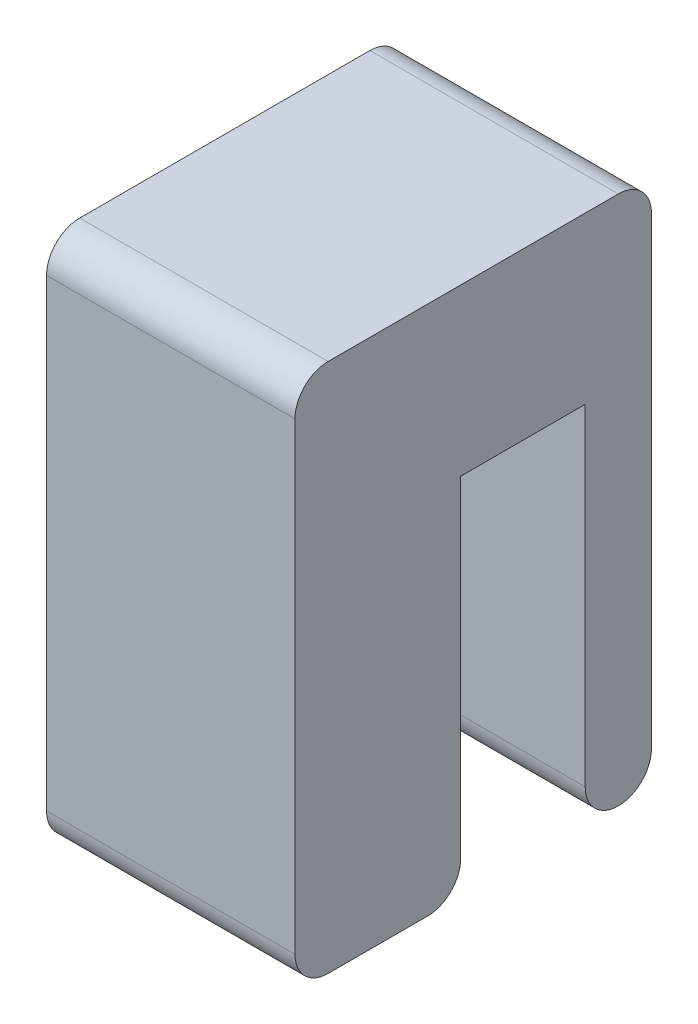
ISO-10303-21;
HEADER;
FILE_DESCRIPTION(('STEP AP214'),'2;1');
FILE_NAME('part.step','',(''),(''),'','','');
FILE_SCHEMA(('AUTOMOTIVE_DESIGN { 1 0 10303 214 1 1 1 1 }'));
ENDSEC;
DATA;
#1=APPLICATION_CONTEXT('core data for automotive mechanical design processes');
#2=APPLICATION_PROTOCOL_DEFINITION('international standard','automotive_design',2000,#1);
#3=PRODUCT_CONTEXT('',#1,'mechanical');
#4=PRODUCT('Part','Part','',(#3));
#5=PRODUCT_RELATED_PRODUCT_CATEGORY('part','',(#4));
#6=PRODUCT_DEFINITION_FORMATION('','',#4);
#7=PRODUCT_DEFINITION_CONTEXT('part definition',#1,'design');
#8=PRODUCT_DEFINITION('design','',#6,#7);
#9=PRODUCT_DEFINITION_SHAPE('','',#8);
#10=(LENGTH_UNIT() NAMED_UNIT(*) SI_UNIT(.MILLI.,.METRE.));
#11=(NAMED_UNIT(*) PLANE_ANGLE_UNIT() SI_UNIT($,.RADIAN.));
#12=(NAMED_UNIT(*) SI_UNIT($,.STERADIAN.) SOLID_ANGLE_UNIT());
#13=UNCERTAINTY_MEASURE_WITH_UNIT(LENGTH_MEASURE(1.E-05),#10,'distance_accuracy_value','');
#14=(GEOMETRIC_REPRESENTATION_CONTEXT(3) GLOBAL_UNCERTAINTY_ASSIGNED_CONTEXT((#13)) GLOBAL_UNIT_ASSIGNED_CONTEXT((#10,
#11,#12)) REPRESENTATION_CONTEXT('',''));
#15=CARTESIAN_POINT('',(0.,0.,0.));
#16=DIRECTION('',(0.,0.,1.));
#17=DIRECTION('',(1.,0.,0.));
#18=AXIS2_PLACEMENT_3D('',#15,#16,#17);
#19=CARTESIAN_POINT('',(19.05,-27.94,12.7));
#20=DIRECTION('',(0.,1.,0.));
#21=DIRECTION('',(0.,0.,1.));
#22=AXIS2_PLACEMENT_3D('',#19,#20,#21);
#23=PLANE('',#22);
#24=DIRECTION('',(0.,0.,-1.));
#25=VECTOR('',#24,1.);
#26=CARTESIAN_POINT('',(0.,-27.94,12.7));
#27=LINE('',#26,#25);
#28=CARTESIAN_POINT('',(0.,-27.94,10.16));
#29=VERTEX_POINT('',#28);
#30=CARTESIAN_POINT('',(0.,-27.94,2.53999999999998));
#31=VERTEX_POINT('',#30);
#32=EDGE_CURVE('E181',#29,#31,#27,.T.);
#33=ORIENTED_EDGE('',*,*,#32,.T.);
#34=DIRECTION('',(-1.,0.,0.));
#35=VECTOR('',#34,1.);
#36=CARTESIAN_POINT('',(19.05,-27.94,2.53999999999997));
#37=LINE('',#36,#35);
#38=CARTESIAN_POINT('',(19.05,-27.94,2.53999999999998));
#39=VERTEX_POINT('',#38);
#40=EDGE_CURVE('E264',#31,#39,#37,.F.);
#41=ORIENTED_EDGE('',*,*,#40,.T.);
#42=DIRECTION('',(0.,0.,-1.));
#43=VECTOR('',#42,1.);
#44=CARTESIAN_POINT('',(19.05,-27.94,12.7));
#45=LINE('',#44,#43);
#46=CARTESIAN_POINT('',(19.05,-27.94,10.16));
#47=VERTEX_POINT('',#46);
#48=EDGE_CURVE('E149',#47,#39,#45,.T.);
#49=ORIENTED_EDGE('',*,*,#48,.F.);
#50=DIRECTION('',(-1.,0.,0.));
#51=VECTOR('',#50,1.);
#52=CARTESIAN_POINT('',(19.05,-27.94,10.16));
#53=LINE('',#52,#51);
#54=EDGE_CURVE('E260',#47,#29,#53,.T.);
#55=ORIENTED_EDGE('',*,*,#54,.T.);
#56=EDGE_LOOP('',(#33,#41,#49,#55));
#57=FACE_BOUND('',#56,.T.);
#58=ADVANCED_FACE('F39',(#57),#23,.F.);
#59=CARTESIAN_POINT('',(19.05,-27.94,0.));
#60=DIRECTION('',(0.,0.,1.));
#61=DIRECTION('',(0.,-1.,0.));
#62=AXIS2_PLACEMENT_3D('',#59,#60,#61);
#63=PLANE('',#62);
#64=DIRECTION('',(0.,1.,0.));
#65=VECTOR('',#64,1.);
#66=CARTESIAN_POINT('',(19.05,-27.94,0.));
#67=LINE('',#66,#65);
#68=CARTESIAN_POINT('',(19.05,-25.4,0.));
#69=VERTEX_POINT('',#68);
#70=CARTESIAN_POINT('',(19.05,0.,0.));
#71=VERTEX_POINT('',#70);
#72=EDGE_CURVE('E134',#69,#71,#67,.T.);
#73=ORIENTED_EDGE('',*,*,#72,.F.);
#74=DIRECTION('',(-1.,0.,0.));
#75=VECTOR('',#74,1.);
#76=CARTESIAN_POINT('',(19.05,-25.4,0.));
#77=LINE('',#76,#75);
#78=CARTESIAN_POINT('',(0.,-25.4,0.));
#79=VERTEX_POINT('',#78);
#80=EDGE_CURVE('E257',#69,#79,#77,.T.);
#81=ORIENTED_EDGE('',*,*,#80,.T.);
#82=DIRECTION('',(0.,1.,0.));
#83=VECTOR('',#82,1.);
#84=CARTESIAN_POINT('',(0.,-27.94,0.));
#85=LINE('',#84,#83);
#86=CARTESIAN_POINT('',(0.,0.,0.));
#87=VERTEX_POINT('',#86);
#88=EDGE_CURVE('E155',#79,#87,#85,.T.);
#89=ORIENTED_EDGE('',*,*,#88,.T.);
#90=DIRECTION('',(-1.,0.,0.));
#91=VECTOR('',#90,1.);
#92=CARTESIAN_POINT('',(19.05,0.,0.));
#93=LINE('',#92,#91);
#94=EDGE_CURVE('E152',#71,#87,#93,.T.);
#95=ORIENTED_EDGE('',*,*,#94,.F.);
#96=EDGE_LOOP('',(#73,#81,#89,#95));
#97=FACE_BOUND('',#96,.T.);
#98=ADVANCED_FACE('F153',(#97),#63,.F.);
#99=CARTESIAN_POINT('',(19.05,0.,0.));
#100=DIRECTION('',(0.,1.,0.));
#101=DIRECTION('',(0.,0.,1.));
#102=AXIS2_PLACEMENT_3D('',#99,#100,#101);
#103=PLANE('',#102);
#104=DIRECTION('',(0.,0.,-1.));
#105=VECTOR('',#104,1.);
#106=CARTESIAN_POINT('',(0.,0.,0.));
#107=LINE('',#106,#105);
#108=CARTESIAN_POINT('',(0.,0.,-9.55040000000001));
#109=VERTEX_POINT('',#108);
#110=EDGE_CURVE('E187',#87,#109,#107,.T.);
#111=ORIENTED_EDGE('',*,*,#110,.T.);
#112=DIRECTION('',(-1.,0.,0.));
#113=VECTOR('',#112,1.);
#114=CARTESIAN_POINT('',(19.05,0.,-9.55040000000001));
#115=LINE('',#114,#113);
#116=CARTESIAN_POINT('',(19.05,0.,-9.55040000000001));
#117=VERTEX_POINT('',#116);
#118=EDGE_CURVE('E160',#117,#109,#115,.T.);
#119=ORIENTED_EDGE('',*,*,#118,.F.);
#120=DIRECTION('',(0.,0.,-1.));
#121=VECTOR('',#120,1.);
#122=CARTESIAN_POINT('',(19.05,0.,0.));
#123=LINE('',#122,#121);
#124=EDGE_CURVE('E140',#71,#117,#123,.T.);
#125=ORIENTED_EDGE('',*,*,#124,.F.);
#126=ORIENTED_EDGE('',*,*,#94,.T.);
#127=EDGE_LOOP('',(#111,#119,#125,#126));
#128=FACE_BOUND('',#127,.T.);
#129=ADVANCED_FACE('F162',(#128),#103,.F.);
#130=CARTESIAN_POINT('',(19.05,0.,-9.55040000000001));
#131=DIRECTION('',(0.,0.,-1.));
#132=DIRECTION('',(-1.,0.,0.));
#133=AXIS2_PLACEMENT_3D('',#130,#131,#132);
#134=PLANE('',#133);
#135=DIRECTION('',(0.,-1.,0.));
#136=VECTOR('',#135,1.);
#137=CARTESIAN_POINT('',(0.,0.,-9.55040000000001));
#138=LINE('',#137,#136);
#139=CARTESIAN_POINT('',(0.,-25.4,-9.55040000000001));
#140=VERTEX_POINT('',#139);
#141=EDGE_CURVE('E190',#109,#140,#138,.T.);
#142=ORIENTED_EDGE('',*,*,#141,.T.);
#143=DIRECTION('',(-1.,0.,0.));
#144=VECTOR('',#143,1.);
#145=CARTESIAN_POINT('',(19.05,-25.4,-9.55040000000001));
#146=LINE('',#145,#144);
#147=CARTESIAN_POINT('',(19.05,-25.4,-9.55040000000001));
#148=VERTEX_POINT('',#147);
#149=EDGE_CURVE('E254',#140,#148,#146,.F.);
#150=ORIENTED_EDGE('',*,*,#149,.T.);
#151=DIRECTION('',(0.,-1.,0.));
#152=VECTOR('',#151,1.);
#153=CARTESIAN_POINT('',(19.05,0.,-9.55040000000001));
#154=LINE('',#153,#152);
#155=EDGE_CURVE('E166',#117,#148,#154,.T.);
#156=ORIENTED_EDGE('',*,*,#155,.F.);
#157=ORIENTED_EDGE('',*,*,#118,.T.);
#158=EDGE_LOOP('',(#142,#150,#156,#157));
#159=FACE_BOUND('',#158,.T.);
#160=ADVANCED_FACE('F300',(#159),#134,.F.);
#161=CARTESIAN_POINT('',(19.05,12.7,-14.6304));
#162=DIRECTION('',(0.,0.,1.));
#163=DIRECTION('',(1.,0.,0.));
#164=AXIS2_PLACEMENT_3D('',#161,#162,#163);
#165=PLANE('',#164);
#166=DIRECTION('',(0.,1.,0.));
#167=VECTOR('',#166,1.);
#168=CARTESIAN_POINT('',(0.,12.7,-14.6304));
#169=LINE('',#168,#167);
#170=CARTESIAN_POINT('',(0.,-25.4,-14.6304));
#171=VERTEX_POINT('',#170);
#172=CARTESIAN_POINT('',(0.,10.16,-14.6304));
#173=VERTEX_POINT('',#172);
#174=EDGE_CURVE('E194',#171,#173,#169,.T.);
#175=ORIENTED_EDGE('',*,*,#174,.T.);
#176=DIRECTION('',(-1.,0.,0.));
#177=VECTOR('',#176,1.);
#178=CARTESIAN_POINT('',(19.05,10.16,-14.6304));
#179=LINE('',#178,#177);
#180=CARTESIAN_POINT('',(19.05,10.16,-14.6304));
#181=VERTEX_POINT('',#180);
#182=EDGE_CURVE('E235',#173,#181,#179,.F.);
#183=ORIENTED_EDGE('',*,*,#182,.T.);
#184=DIRECTION('',(0.,1.,0.));
#185=VECTOR('',#184,1.);
#186=CARTESIAN_POINT('',(19.05,12.7,-14.6304));
#187=LINE('',#186,#185);
#188=CARTESIAN_POINT('',(19.05,-25.4,-14.6304));
#189=VERTEX_POINT('',#188);
#190=EDGE_CURVE('E169',#189,#181,#187,.T.);
#191=ORIENTED_EDGE('',*,*,#190,.F.);
#192=DIRECTION('',(-1.,0.,0.));
#193=VECTOR('',#192,1.);
#194=CARTESIAN_POINT('',(19.05,-25.4,-14.6304));
#195=LINE('',#194,#193);
#196=EDGE_CURVE('E231',#189,#171,#195,.T.);
#197=ORIENTED_EDGE('',*,*,#196,.T.);
#198=EDGE_LOOP('',(#175,#183,#191,#197));
#199=FACE_BOUND('',#198,.T.);
#200=ADVANCED_FACE('F304',(#199),#165,.F.);
#201=CARTESIAN_POINT('',(19.05,12.7,-14.6304));
#202=DIRECTION('',(0.,-1.,0.));
#203=DIRECTION('',(0.,0.,-1.));
#204=AXIS2_PLACEMENT_3D('',#201,#202,#203);
#205=PLANE('',#204);
#206=DIRECTION('',(0.,0.,1.));
#207=VECTOR('',#206,1.);
#208=CARTESIAN_POINT('',(19.05,12.7,-14.6304));
#209=LINE('',#208,#207);
#210=CARTESIAN_POINT('',(19.05,12.7,-12.0904));
#211=VERTEX_POINT('',#210);
#212=CARTESIAN_POINT('',(19.05,12.7,10.16));
#213=VERTEX_POINT('',#212);
#214=EDGE_CURVE('E175',#211,#213,#209,.T.);
#215=ORIENTED_EDGE('',*,*,#214,.F.);
#216=DIRECTION('',(-1.,0.,0.));
#217=VECTOR('',#216,1.);
#218=CARTESIAN_POINT('',(19.05,12.7,-12.0904));
#219=LINE('',#218,#217);
#220=CARTESIAN_POINT('',(0.,12.7,-12.0904));
#221=VERTEX_POINT('',#220);
#222=EDGE_CURVE('E209',#211,#221,#219,.T.);
#223=ORIENTED_EDGE('',*,*,#222,.T.);
#224=DIRECTION('',(0.,0.,1.));
#225=VECTOR('',#224,1.);
#226=CARTESIAN_POINT('',(0.,12.7,-14.6304));
#227=LINE('',#226,#225);
#228=CARTESIAN_POINT('',(0.,12.7,10.16));
#229=VERTEX_POINT('',#228);
#230=EDGE_CURVE('E198',#221,#229,#227,.T.);
#231=ORIENTED_EDGE('',*,*,#230,.T.);
#232=DIRECTION('',(-1.,0.,0.));
#233=VECTOR('',#232,1.);
#234=CARTESIAN_POINT('',(19.05,12.7,10.16));
#235=LINE('',#234,#233);
#236=EDGE_CURVE('E159',#229,#213,#235,.F.);
#237=ORIENTED_EDGE('',*,*,#236,.T.);
#238=EDGE_LOOP('',(#215,#223,#231,#237));
#239=FACE_BOUND('',#238,.T.);
#240=ADVANCED_FACE('F311',(#239),#205,.F.);
#241=CARTESIAN_POINT('',(19.05,12.7,12.7));
#242=DIRECTION('',(0.,0.,-1.));
#243=DIRECTION('',(-1.,0.,0.));
#244=AXIS2_PLACEMENT_3D('',#241,#242,#243);
#245=PLANE('',#244);
#246=DIRECTION('',(0.,-1.,0.));
#247=VECTOR('',#246,1.);
#248=CARTESIAN_POINT('',(0.,12.7,12.7));
#249=LINE('',#248,#247);
#250=CARTESIAN_POINT('',(0.,10.16,12.7));
#251=VERTEX_POINT('',#250);
#252=CARTESIAN_POINT('',(0.,-25.4,12.7));
#253=VERTEX_POINT('',#252);
#254=EDGE_CURVE('E202',#251,#253,#249,.T.);
#255=ORIENTED_EDGE('',*,*,#254,.T.);
#256=DIRECTION('',(-1.,0.,0.));
#257=VECTOR('',#256,1.);
#258=CARTESIAN_POINT('',(19.05,-25.4,12.7));
#259=LINE('',#258,#257);
#260=CARTESIAN_POINT('',(19.05,-25.4,12.7));
#261=VERTEX_POINT('',#260);
#262=EDGE_CURVE('E11',#253,#261,#259,.F.);
#263=ORIENTED_EDGE('',*,*,#262,.T.);
#264=DIRECTION('',(0.,-1.,0.));
#265=VECTOR('',#264,1.);
#266=CARTESIAN_POINT('',(19.05,12.7,12.7));
#267=LINE('',#266,#265);
#268=CARTESIAN_POINT('',(19.05,10.16,12.7));
#269=VERTEX_POINT('',#268);
#270=EDGE_CURVE('E178',#269,#261,#267,.T.);
#271=ORIENTED_EDGE('',*,*,#270,.F.);
#272=DIRECTION('',(-1.,0.,0.));
#273=VECTOR('',#272,1.);
#274=CARTESIAN_POINT('',(19.05,10.16,12.7));
#275=LINE('',#274,#273);
#276=EDGE_CURVE('E49',#269,#251,#275,.T.);
#277=ORIENTED_EDGE('',*,*,#276,.T.);
#278=EDGE_LOOP('',(#255,#263,#271,#277));
#279=FACE_BOUND('',#278,.T.);
#280=ADVANCED_FACE('F271',(#279),#245,.F.);
#281=CARTESIAN_POINT('',(19.05,0.,0.));
#282=DIRECTION('',(1.,0.,0.));
#283=DIRECTION('',(0.,0.,-1.));
#284=AXIS2_PLACEMENT_3D('',#281,#282,#283);
#285=PLANE('',#284);
#286=ORIENTED_EDGE('',*,*,#190,.T.);
#287=CARTESIAN_POINT('',(19.05,10.16,-12.0904));
#288=DIRECTION('',(1.,0.,0.));
#289=DIRECTION('',(0.,0.,-1.));
#290=AXIS2_PLACEMENT_3D('',#287,#288,#289);
#291=CIRCLE('',#290,2.54);
#292=EDGE_CURVE('E251',#181,#211,#291,.T.);
#293=ORIENTED_EDGE('',*,*,#292,.T.);
#294=ORIENTED_EDGE('',*,*,#214,.T.);
#295=CARTESIAN_POINT('',(19.05,10.16,10.16));
#296=DIRECTION('',(1.,0.,0.));
#297=DIRECTION('',(0.,0.,-1.));
#298=AXIS2_PLACEMENT_3D('',#295,#296,#297);
#299=CIRCLE('',#298,2.54);
#300=EDGE_CURVE('E61',#213,#269,#299,.T.);
#301=ORIENTED_EDGE('',*,*,#300,.T.);
#302=ORIENTED_EDGE('',*,*,#270,.T.);
#303=CARTESIAN_POINT('',(19.05,-25.4,10.16));
#304=DIRECTION('',(1.,0.,0.));
#305=DIRECTION('',(0.,0.,-1.));
#306=AXIS2_PLACEMENT_3D('',#303,#304,#305);
#307=CIRCLE('',#306,2.54);
#308=EDGE_CURVE('E240',#261,#47,#307,.T.);
#309=ORIENTED_EDGE('',*,*,#308,.T.);
#310=ORIENTED_EDGE('',*,*,#48,.T.);
#311=CARTESIAN_POINT('',(19.05,-25.4,2.53999999999997));
#312=DIRECTION('',(1.,0.,0.));
#313=DIRECTION('',(0.,0.,-1.));
#314=AXIS2_PLACEMENT_3D('',#311,#312,#313);
#315=CIRCLE('',#314,2.54);
#316=EDGE_CURVE('E144',#39,#69,#315,.T.);
#317=ORIENTED_EDGE('',*,*,#316,.T.);
#318=ORIENTED_EDGE('',*,*,#72,.T.);
#319=ORIENTED_EDGE('',*,*,#124,.T.);
#320=ORIENTED_EDGE('',*,*,#155,.T.);
#321=CARTESIAN_POINT('',(19.05,-25.4,-12.0904));
#322=DIRECTION('',(1.,0.,0.));
#323=DIRECTION('',(0.,0.,-1.));
#324=AXIS2_PLACEMENT_3D('',#321,#322,#323);
#325=CIRCLE('',#324,2.54);
#326=CARTESIAN_POINT('',(19.05,-27.94,-12.0904));
#327=VERTEX_POINT('',#326);
#328=EDGE_CURVE('E245',#148,#327,#325,.T.);
#329=ORIENTED_EDGE('',*,*,#328,.T.);
#330=CARTESIAN_POINT('',(19.05,-25.4,-12.0904));
#331=DIRECTION('',(1.,0.,0.));
#332=DIRECTION('',(0.,0.,-1.));
#333=AXIS2_PLACEMENT_3D('',#330,#331,#332);
#334=CIRCLE('',#333,2.54);
#335=EDGE_CURVE('E248',#327,#189,#334,.T.);
#336=ORIENTED_EDGE('',*,*,#335,.T.);
#337=EDGE_LOOP('',(#286,#293,#294,#301,#302,#309,#310,#317,#318,#319,#320,#329,#336));
#338=FACE_BOUND('',#337,.T.);
#339=ADVANCED_FACE('F137',(#338),#285,.T.);
#340=CARTESIAN_POINT('',(0.,0.,0.));
#341=DIRECTION('',(1.,0.,0.));
#342=DIRECTION('',(0.,0.,-1.));
#343=AXIS2_PLACEMENT_3D('',#340,#341,#342);
#344=PLANE('',#343);
#345=ORIENTED_EDGE('',*,*,#230,.F.);
#346=CARTESIAN_POINT('',(0.,10.16,-12.0904));
#347=DIRECTION('',(1.,0.,0.));
#348=DIRECTION('',(0.,0.,-1.));
#349=AXIS2_PLACEMENT_3D('',#346,#347,#348);
#350=CIRCLE('',#349,2.54);
#351=EDGE_CURVE('E228',#221,#173,#350,.F.);
#352=ORIENTED_EDGE('',*,*,#351,.T.);
#353=ORIENTED_EDGE('',*,*,#174,.F.);
#354=CARTESIAN_POINT('',(0.,-25.4,-12.0904));
#355=DIRECTION('',(1.,0.,0.));
#356=DIRECTION('',(0.,0.,-1.));
#357=AXIS2_PLACEMENT_3D('',#354,#355,#356);
#358=CIRCLE('',#357,2.54);
#359=CARTESIAN_POINT('',(0.,-27.94,-12.0904));
#360=VERTEX_POINT('',#359);
#361=EDGE_CURVE('E225',#171,#360,#358,.F.);
#362=ORIENTED_EDGE('',*,*,#361,.T.);
#363=CARTESIAN_POINT('',(0.,-25.4,-12.0904));
#364=DIRECTION('',(1.,0.,0.));
#365=DIRECTION('',(0.,0.,-1.));
#366=AXIS2_PLACEMENT_3D('',#363,#364,#365);
#367=CIRCLE('',#366,2.54);
#368=EDGE_CURVE('E222',#360,#140,#367,.F.);
#369=ORIENTED_EDGE('',*,*,#368,.T.);
#370=ORIENTED_EDGE('',*,*,#141,.F.);
#371=ORIENTED_EDGE('',*,*,#110,.F.);
#372=ORIENTED_EDGE('',*,*,#88,.F.);
#373=CARTESIAN_POINT('',(0.,-25.4,2.53999999999997));
#374=DIRECTION('',(1.,0.,0.));
#375=DIRECTION('',(0.,0.,-1.));
#376=AXIS2_PLACEMENT_3D('',#373,#374,#375);
#377=CIRCLE('',#376,2.54);
#378=EDGE_CURVE('E219',#79,#31,#377,.F.);
#379=ORIENTED_EDGE('',*,*,#378,.T.);
#380=ORIENTED_EDGE('',*,*,#32,.F.);
#381=CARTESIAN_POINT('',(0.,-25.4,10.16));
#382=DIRECTION('',(1.,0.,0.));
#383=DIRECTION('',(0.,0.,-1.));
#384=AXIS2_PLACEMENT_3D('',#381,#382,#383);
#385=CIRCLE('',#384,2.54);
#386=EDGE_CURVE('E216',#29,#253,#385,.F.);
#387=ORIENTED_EDGE('',*,*,#386,.T.);
#388=ORIENTED_EDGE('',*,*,#254,.F.);
#389=CARTESIAN_POINT('',(0.,10.16,10.16));
#390=DIRECTION('',(1.,0.,0.));
#391=DIRECTION('',(0.,0.,-1.));
#392=AXIS2_PLACEMENT_3D('',#389,#390,#391);
#393=CIRCLE('',#392,2.54);
#394=EDGE_CURVE('E213',#251,#229,#393,.F.);
#395=ORIENTED_EDGE('',*,*,#394,.T.);
#396=EDGE_LOOP('',(#345,#352,#353,#362,#369,#370,#371,#372,#379,#380,#387,#388,#395));
#397=FACE_BOUND('',#396,.T.);
#398=ADVANCED_FACE('F275',(#397),#344,.F.);
#399=CARTESIAN_POINT('',(19.05,10.16,-12.0904));
#400=DIRECTION('',(-1.,0.,0.));
#401=DIRECTION('',(0.,0.,1.));
#402=AXIS2_PLACEMENT_3D('',#399,#400,#401);
#403=CYLINDRICAL_SURFACE('',#402,2.54);
#404=ORIENTED_EDGE('',*,*,#292,.F.);
#405=ORIENTED_EDGE('',*,*,#182,.F.);
#406=ORIENTED_EDGE('',*,*,#351,.F.);
#407=ORIENTED_EDGE('',*,*,#222,.F.);
#408=EDGE_LOOP('',(#404,#405,#406,#407));
#409=FACE_BOUND('',#408,.T.);
#410=ADVANCED_FACE('F307',(#409),#403,.T.);
#411=CARTESIAN_POINT('',(19.05,-25.4,-12.0904));
#412=DIRECTION('',(-1.,0.,0.));
#413=DIRECTION('',(0.,0.,1.));
#414=AXIS2_PLACEMENT_3D('',#411,#412,#413);
#415=CYLINDRICAL_SURFACE('',#414,2.54);
#416=DIRECTION('',(-1.,0.,0.));
#417=VECTOR('',#416,1.);
#418=CARTESIAN_POINT('',(19.05,-27.94,-12.0904));
#419=LINE('',#418,#417);
#420=EDGE_CURVE('E43',#327,#360,#419,.T.);
#421=ORIENTED_EDGE('',*,*,#420,.F.);
#422=ORIENTED_EDGE('',*,*,#328,.F.);
#423=ORIENTED_EDGE('',*,*,#149,.F.);
#424=ORIENTED_EDGE('',*,*,#368,.F.);
#425=EDGE_LOOP('',(#421,#422,#423,#424));
#426=FACE_BOUND('',#425,.T.);
#427=ADVANCED_FACE('F295',(#426),#415,.T.);
#428=CARTESIAN_POINT('',(19.05,-25.4,-12.0904));
#429=DIRECTION('',(-1.,0.,0.));
#430=DIRECTION('',(0.,0.,1.));
#431=AXIS2_PLACEMENT_3D('',#428,#429,#430);
#432=CYLINDRICAL_SURFACE('',#431,2.54);
#433=ORIENTED_EDGE('',*,*,#335,.F.);
#434=ORIENTED_EDGE('',*,*,#420,.T.);
#435=ORIENTED_EDGE('',*,*,#361,.F.);
#436=ORIENTED_EDGE('',*,*,#196,.F.);
#437=EDGE_LOOP('',(#433,#434,#435,#436));
#438=FACE_BOUND('',#437,.T.);
#439=ADVANCED_FACE('F290',(#438),#432,.T.);
#440=CARTESIAN_POINT('',(19.05,-25.4,2.53999999999997));
#441=DIRECTION('',(-1.,0.,0.));
#442=DIRECTION('',(0.,0.,1.));
#443=AXIS2_PLACEMENT_3D('',#440,#441,#442);
#444=CYLINDRICAL_SURFACE('',#443,2.54);
#445=ORIENTED_EDGE('',*,*,#316,.F.);
#446=ORIENTED_EDGE('',*,*,#40,.F.);
#447=ORIENTED_EDGE('',*,*,#378,.F.);
#448=ORIENTED_EDGE('',*,*,#80,.F.);
#449=EDGE_LOOP('',(#445,#446,#447,#448));
#450=FACE_BOUND('',#449,.T.);
#451=ADVANCED_FACE('F317',(#450),#444,.T.);
#452=CARTESIAN_POINT('',(19.05,-25.4,10.16));
#453=DIRECTION('',(-1.,0.,0.));
#454=DIRECTION('',(0.,0.,1.));
#455=AXIS2_PLACEMENT_3D('',#452,#453,#454);
#456=CYLINDRICAL_SURFACE('',#455,2.54);
#457=ORIENTED_EDGE('',*,*,#308,.F.);
#458=ORIENTED_EDGE('',*,*,#262,.F.);
#459=ORIENTED_EDGE('',*,*,#386,.F.);
#460=ORIENTED_EDGE('',*,*,#54,.F.);
#461=EDGE_LOOP('',(#457,#458,#459,#460));
#462=FACE_BOUND('',#461,.T.);
#463=ADVANCED_FACE('F280',(#462),#456,.T.);
#464=CARTESIAN_POINT('',(19.05,10.16,10.16));
#465=DIRECTION('',(-1.,0.,0.));
#466=DIRECTION('',(0.,0.,1.));
#467=AXIS2_PLACEMENT_3D('',#464,#465,#466);
#468=CYLINDRICAL_SURFACE('',#467,2.54);
#469=ORIENTED_EDGE('',*,*,#300,.F.);
#470=ORIENTED_EDGE('',*,*,#236,.F.);
#471=ORIENTED_EDGE('',*,*,#394,.F.);
#472=ORIENTED_EDGE('',*,*,#276,.F.);
#473=EDGE_LOOP('',(#469,#470,#471,#472));
#474=FACE_BOUND('',#473,.T.);
#475=ADVANCED_FACE('F41',(#474),#468,.T.);
#476=CLOSED_SHELL('',(#58,#98,#129,#160,#200,#240,#280,#339,#398,#410,#427,#439,#451,#463,#475));
#477=MANIFOLD_SOLID_BREP('B2',#476);
#478=ADVANCED_BREP_SHAPE_REPRESENTATION('',(#18,#477),#14);
#479=SHAPE_DEFINITION_REPRESENTATION(#9,#478);
ENDSEC;
END-ISO-10303-21;
